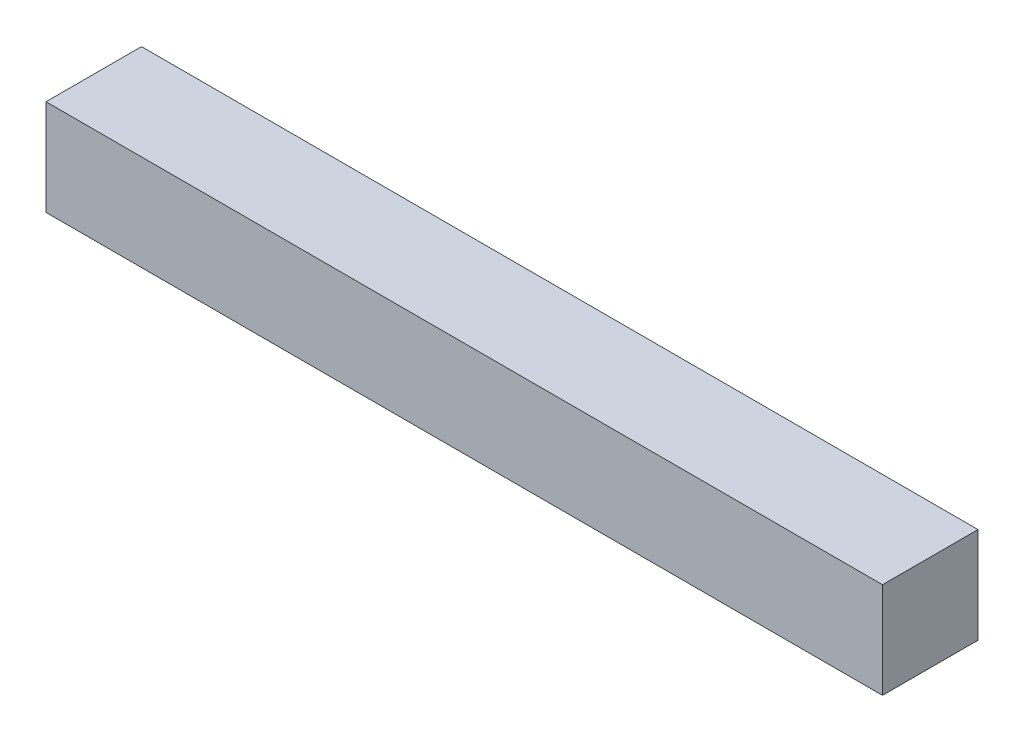
ISO-10303-21;
HEADER;
FILE_DESCRIPTION(('STEP AP214'),'2;1');
FILE_NAME('part.step','',(''),(''),'','','');
FILE_SCHEMA(('AUTOMOTIVE_DESIGN { 1 0 10303 214 1 1 1 1 }'));
ENDSEC;
DATA;
#1=APPLICATION_CONTEXT('core data for automotive mechanical design processes');
#2=APPLICATION_PROTOCOL_DEFINITION('international standard','automotive_design',2000,#1);
#3=PRODUCT_CONTEXT('',#1,'mechanical');
#4=PRODUCT('Part','Part','',(#3));
#5=PRODUCT_RELATED_PRODUCT_CATEGORY('part','',(#4));
#6=PRODUCT_DEFINITION_FORMATION('','',#4);
#7=PRODUCT_DEFINITION_CONTEXT('part definition',#1,'design');
#8=PRODUCT_DEFINITION('design','',#6,#7);
#9=PRODUCT_DEFINITION_SHAPE('','',#8);
#10=(LENGTH_UNIT() NAMED_UNIT(*) SI_UNIT(.MILLI.,.METRE.));
#11=(NAMED_UNIT(*) PLANE_ANGLE_UNIT() SI_UNIT($,.RADIAN.));
#12=(NAMED_UNIT(*) SI_UNIT($,.STERADIAN.) SOLID_ANGLE_UNIT());
#13=UNCERTAINTY_MEASURE_WITH_UNIT(LENGTH_MEASURE(1.E-05),#10,'distance_accuracy_value','');
#14=(GEOMETRIC_REPRESENTATION_CONTEXT(3) GLOBAL_UNCERTAINTY_ASSIGNED_CONTEXT((#13)) GLOBAL_UNIT_ASSIGNED_CONTEXT((#10,
#11,#12)) REPRESENTATION_CONTEXT('',''));
#15=CARTESIAN_POINT('',(0.,0.,0.));
#16=DIRECTION('',(0.,0.,1.));
#17=DIRECTION('',(1.,0.,0.));
#18=AXIS2_PLACEMENT_3D('',#15,#16,#17);
#19=CARTESIAN_POINT('',(304.8,0.,0.));
#20=DIRECTION('',(0.,0.,-1.));
#21=DIRECTION('',(-1.,0.,0.));
#22=AXIS2_PLACEMENT_3D('',#19,#20,#21);
#23=PLANE('',#22);
#24=DIRECTION('',(0.,-1.,0.));
#25=VECTOR('',#24,1.);
#26=CARTESIAN_POINT('',(0.,0.,0.));
#27=LINE('',#26,#25);
#28=CARTESIAN_POINT('',(0.,34.925,0.));
#29=VERTEX_POINT('',#28);
#30=CARTESIAN_POINT('',(0.,0.,0.));
#31=VERTEX_POINT('',#30);
#32=EDGE_CURVE('E96',#29,#31,#27,.T.);
#33=ORIENTED_EDGE('',*,*,#32,.T.);
#34=DIRECTION('',(-1.,0.,0.));
#35=VECTOR('',#34,1.);
#36=CARTESIAN_POINT('',(304.8,0.,0.));
#37=LINE('',#36,#35);
#38=CARTESIAN_POINT('',(304.8,0.,0.));
#39=VERTEX_POINT('',#38);
#40=EDGE_CURVE('E11',#39,#31,#37,.T.);
#41=ORIENTED_EDGE('',*,*,#40,.F.);
#42=DIRECTION('',(0.,-1.,0.));
#43=VECTOR('',#42,1.);
#44=CARTESIAN_POINT('',(304.8,0.,0.));
#45=LINE('',#44,#43);
#46=CARTESIAN_POINT('',(304.8,34.925,0.));
#47=VERTEX_POINT('',#46);
#48=EDGE_CURVE('E84',#47,#39,#45,.T.);
#49=ORIENTED_EDGE('',*,*,#48,.F.);
#50=DIRECTION('',(-1.,0.,0.));
#51=VECTOR('',#50,1.);
#52=CARTESIAN_POINT('',(304.8,34.925,0.));
#53=LINE('',#52,#51);
#54=EDGE_CURVE('E92',#47,#29,#53,.T.);
#55=ORIENTED_EDGE('',*,*,#54,.T.);
#56=EDGE_LOOP('',(#33,#41,#49,#55));
#57=FACE_BOUND('',#56,.T.);
#58=ADVANCED_FACE('F33',(#57),#23,.F.);
#59=CARTESIAN_POINT('',(304.8,0.,0.));
#60=DIRECTION('',(0.,1.,0.));
#61=DIRECTION('',(0.,0.,1.));
#62=AXIS2_PLACEMENT_3D('',#59,#60,#61);
#63=PLANE('',#62);
#64=DIRECTION('',(0.,0.,-1.));
#65=VECTOR('',#64,1.);
#66=CARTESIAN_POINT('',(0.,0.,0.));
#67=LINE('',#66,#65);
#68=CARTESIAN_POINT('',(0.,0.,-34.798));
#69=VERTEX_POINT('',#68);
#70=EDGE_CURVE('E88',#31,#69,#67,.T.);
#71=ORIENTED_EDGE('',*,*,#70,.T.);
#72=DIRECTION('',(-1.,0.,0.));
#73=VECTOR('',#72,1.);
#74=CARTESIAN_POINT('',(304.8,0.,-34.798));
#75=LINE('',#74,#73);
#76=CARTESIAN_POINT('',(304.8,0.,-34.798));
#77=VERTEX_POINT('',#76);
#78=EDGE_CURVE('E41',#77,#69,#75,.T.);
#79=ORIENTED_EDGE('',*,*,#78,.F.);
#80=DIRECTION('',(0.,0.,-1.));
#81=VECTOR('',#80,1.);
#82=CARTESIAN_POINT('',(304.8,0.,0.));
#83=LINE('',#82,#81);
#84=EDGE_CURVE('E79',#39,#77,#83,.T.);
#85=ORIENTED_EDGE('',*,*,#84,.F.);
#86=ORIENTED_EDGE('',*,*,#40,.T.);
#87=EDGE_LOOP('',(#71,#79,#85,#86));
#88=FACE_BOUND('',#87,.T.);
#89=ADVANCED_FACE('F87',(#88),#63,.F.);
#90=CARTESIAN_POINT('',(304.8,0.,-34.798));
#91=DIRECTION('',(0.,0.,1.));
#92=DIRECTION('',(1.,0.,0.));
#93=AXIS2_PLACEMENT_3D('',#90,#91,#92);
#94=PLANE('',#93);
#95=DIRECTION('',(0.,1.,0.));
#96=VECTOR('',#95,1.);
#97=CARTESIAN_POINT('',(0.,0.,-34.798));
#98=LINE('',#97,#96);
#99=CARTESIAN_POINT('',(0.,34.925,-34.798));
#100=VERTEX_POINT('',#99);
#101=EDGE_CURVE('E66',#69,#100,#98,.T.);
#102=ORIENTED_EDGE('',*,*,#101,.T.);
#103=DIRECTION('',(-1.,0.,0.));
#104=VECTOR('',#103,1.);
#105=CARTESIAN_POINT('',(304.8,34.925,-34.798));
#106=LINE('',#105,#104);
#107=CARTESIAN_POINT('',(304.8,34.925,-34.798));
#108=VERTEX_POINT('',#107);
#109=EDGE_CURVE('E89',#108,#100,#106,.T.);
#110=ORIENTED_EDGE('',*,*,#109,.F.);
#111=DIRECTION('',(0.,1.,0.));
#112=VECTOR('',#111,1.);
#113=CARTESIAN_POINT('',(304.8,0.,-34.798));
#114=LINE('',#113,#112);
#115=EDGE_CURVE('E82',#77,#108,#114,.T.);
#116=ORIENTED_EDGE('',*,*,#115,.F.);
#117=ORIENTED_EDGE('',*,*,#78,.T.);
#118=EDGE_LOOP('',(#102,#110,#116,#117));
#119=FACE_BOUND('',#118,.T.);
#120=ADVANCED_FACE('F90',(#119),#94,.F.);
#121=CARTESIAN_POINT('',(304.8,34.925,0.));
#122=DIRECTION('',(0.,-1.,0.));
#123=DIRECTION('',(0.,0.,-1.));
#124=AXIS2_PLACEMENT_3D('',#121,#122,#123);
#125=PLANE('',#124);
#126=DIRECTION('',(0.,0.,1.));
#127=VECTOR('',#126,1.);
#128=CARTESIAN_POINT('',(0.,34.925,0.));
#129=LINE('',#128,#127);
#130=EDGE_CURVE('E72',#100,#29,#129,.T.);
#131=ORIENTED_EDGE('',*,*,#130,.T.);
#132=ORIENTED_EDGE('',*,*,#54,.F.);
#133=DIRECTION('',(0.,0.,1.));
#134=VECTOR('',#133,1.);
#135=CARTESIAN_POINT('',(304.8,34.925,0.));
#136=LINE('',#135,#134);
#137=EDGE_CURVE('E49',#108,#47,#136,.T.);
#138=ORIENTED_EDGE('',*,*,#137,.F.);
#139=ORIENTED_EDGE('',*,*,#109,.T.);
#140=EDGE_LOOP('',(#131,#132,#138,#139));
#141=FACE_BOUND('',#140,.T.);
#142=ADVANCED_FACE('F103',(#141),#125,.F.);
#143=CARTESIAN_POINT('',(304.8,0.,0.));
#144=DIRECTION('',(-1.,0.,0.));
#145=DIRECTION('',(0.,0.,1.));
#146=AXIS2_PLACEMENT_3D('',#143,#144,#145);
#147=PLANE('',#146);
#148=ORIENTED_EDGE('',*,*,#48,.T.);
#149=ORIENTED_EDGE('',*,*,#84,.T.);
#150=ORIENTED_EDGE('',*,*,#115,.T.);
#151=ORIENTED_EDGE('',*,*,#137,.T.);
#152=EDGE_LOOP('',(#148,#149,#150,#151));
#153=FACE_BOUND('',#152,.T.);
#154=ADVANCED_FACE('F80',(#153),#147,.F.);
#155=CARTESIAN_POINT('',(0.,0.,0.));
#156=DIRECTION('',(-1.,0.,0.));
#157=DIRECTION('',(0.,0.,1.));
#158=AXIS2_PLACEMENT_3D('',#155,#156,#157);
#159=PLANE('',#158);
#160=ORIENTED_EDGE('',*,*,#32,.F.);
#161=ORIENTED_EDGE('',*,*,#130,.F.);
#162=ORIENTED_EDGE('',*,*,#101,.F.);
#163=ORIENTED_EDGE('',*,*,#70,.F.);
#164=EDGE_LOOP('',(#160,#161,#162,#163));
#165=FACE_BOUND('',#164,.T.);
#166=ADVANCED_FACE('F106',(#165),#159,.T.);
#167=CLOSED_SHELL('',(#58,#89,#120,#142,#154,#166));
#168=MANIFOLD_SOLID_BREP('B2',#167);
#169=ADVANCED_BREP_SHAPE_REPRESENTATION('',(#18,#168),#14);
#170=SHAPE_DEFINITION_REPRESENTATION(#9,#169);
ENDSEC;
END-ISO-10303-21;
